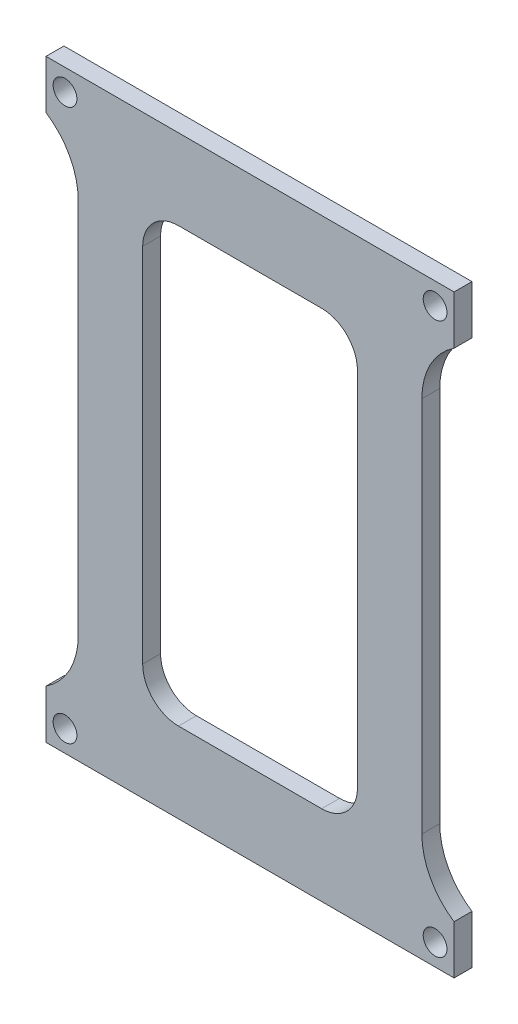
ISO-10303-21;
HEADER;
FILE_DESCRIPTION(('STEP AP214'),'2;1');
FILE_NAME('part.step','',(''),(''),'','','');
FILE_SCHEMA(('AUTOMOTIVE_DESIGN { 1 0 10303 214 1 1 1 1 }'));
ENDSEC;
DATA;
#1=APPLICATION_CONTEXT('core data for automotive mechanical design processes');
#2=APPLICATION_PROTOCOL_DEFINITION('international standard','automotive_design',2000,#1);
#3=PRODUCT_CONTEXT('',#1,'mechanical');
#4=PRODUCT('Part','Part','',(#3));
#5=PRODUCT_RELATED_PRODUCT_CATEGORY('part','',(#4));
#6=PRODUCT_DEFINITION_FORMATION('','',#4);
#7=PRODUCT_DEFINITION_CONTEXT('part definition',#1,'design');
#8=PRODUCT_DEFINITION('design','',#6,#7);
#9=PRODUCT_DEFINITION_SHAPE('','',#8);
#10=(LENGTH_UNIT() NAMED_UNIT(*) SI_UNIT(.MILLI.,.METRE.));
#11=(NAMED_UNIT(*) PLANE_ANGLE_UNIT() SI_UNIT($,.RADIAN.));
#12=(NAMED_UNIT(*) SI_UNIT($,.STERADIAN.) SOLID_ANGLE_UNIT());
#13=UNCERTAINTY_MEASURE_WITH_UNIT(LENGTH_MEASURE(1.E-05),#10,'distance_accuracy_value','');
#14=(GEOMETRIC_REPRESENTATION_CONTEXT(3) GLOBAL_UNCERTAINTY_ASSIGNED_CONTEXT((#13)) GLOBAL_UNIT_ASSIGNED_CONTEXT((#10,
#11,#12)) REPRESENTATION_CONTEXT('',''));
#15=CARTESIAN_POINT('',(0.,0.,0.));
#16=DIRECTION('',(0.,0.,1.));
#17=DIRECTION('',(1.,0.,0.));
#18=AXIS2_PLACEMENT_3D('',#15,#16,#17);
#19=CARTESIAN_POINT('',(-33.7285720078348,26.9956100105943,2.5));
#20=DIRECTION('',(0.,0.,1.));
#21=DIRECTION('',(1.,0.,0.));
#22=AXIS2_PLACEMENT_3D('',#19,#20,#21);
#23=PLANE('',#22);
#24=DIRECTION('',(0.,1.,0.));
#25=VECTOR('',#24,1.);
#26=CARTESIAN_POINT('',(28.7714279921653,48.9155209035442,2.5));
#27=LINE('',#26,#25);
#28=CARTESIAN_POINT('',(28.7714279921653,35.3472565548393,2.5));
#29=VERTEX_POINT('',#28);
#30=CARTESIAN_POINT('',(28.7714279921653,42.160761400506,2.5));
#31=VERTEX_POINT('',#30);
#32=EDGE_CURVE('E256',#29,#31,#27,.T.);
#33=ORIENTED_EDGE('',*,*,#32,.T.);
#34=DIRECTION('',(-1.,0.,0.));
#35=VECTOR('',#34,1.);
#36=CARTESIAN_POINT('',(21.9714279921651,42.160761400506,2.5));
#37=LINE('',#36,#35);
#38=CARTESIAN_POINT('',(-28.2285720078348,42.160761400506,2.5));
#39=VERTEX_POINT('',#38);
#40=EDGE_CURVE('E212',#31,#39,#37,.T.);
#41=ORIENTED_EDGE('',*,*,#40,.T.);
#42=DIRECTION('',(0.,-1.,0.));
#43=VECTOR('',#42,1.);
#44=CARTESIAN_POINT('',(-28.2285720078348,48.9155209035442,2.5));
#45=LINE('',#44,#43);
#46=CARTESIAN_POINT('',(-28.2285720078348,35.3472565548394,2.5));
#47=VERTEX_POINT('',#46);
#48=EDGE_CURVE('E180',#39,#47,#45,.T.);
#49=ORIENTED_EDGE('',*,*,#48,.T.);
#50=CARTESIAN_POINT('',(-33.7285720078348,26.9956100105943,2.5));
#51=DIRECTION('',(0.,0.,-1.));
#52=DIRECTION('',(1.,0.,0.));
#53=AXIS2_PLACEMENT_3D('',#50,#51,#52);
#54=CIRCLE('',#53,10.);
#55=CARTESIAN_POINT('',(-23.7285720078348,26.9956100105943,2.5));
#56=VERTEX_POINT('',#55);
#57=EDGE_CURVE('E198',#47,#56,#54,.T.);
#58=ORIENTED_EDGE('',*,*,#57,.T.);
#59=DIRECTION('',(0.,-1.,0.));
#60=VECTOR('',#59,1.);
#61=CARTESIAN_POINT('',(-23.7285720078348,-25.6740872095823,2.5));
#62=LINE('',#61,#60);
#63=CARTESIAN_POINT('',(-23.7285720078348,-25.6740872095823,2.5));
#64=VERTEX_POINT('',#63);
#65=EDGE_CURVE('E201',#56,#64,#62,.T.);
#66=ORIENTED_EDGE('',*,*,#65,.T.);
#67=CARTESIAN_POINT('',(-33.7285720078348,-25.6740872095823,2.5));
#68=DIRECTION('',(0.,0.,-1.));
#69=DIRECTION('',(1.,0.,0.));
#70=AXIS2_PLACEMENT_3D('',#67,#68,#69);
#71=CIRCLE('',#70,10.);
#72=CARTESIAN_POINT('',(-28.2285720078348,-34.0257337538274,2.5));
#73=VERTEX_POINT('',#72);
#74=EDGE_CURVE('E360',#64,#73,#71,.T.);
#75=ORIENTED_EDGE('',*,*,#74,.T.);
#76=CARTESIAN_POINT('',(-28.2285720078348,-40.839238599494,2.5));
#77=VERTEX_POINT('',#76);
#78=EDGE_CURVE('E259',#73,#77,#45,.T.);
#79=ORIENTED_EDGE('',*,*,#78,.T.);
#80=DIRECTION('',(1.,0.,0.));
#81=VECTOR('',#80,1.);
#82=CARTESIAN_POINT('',(-21.4285720078349,-40.839238599494,2.5));
#83=LINE('',#82,#81);
#84=CARTESIAN_POINT('',(28.7714279921653,-40.839238599494,2.5));
#85=VERTEX_POINT('',#84);
#86=EDGE_CURVE('E363',#77,#85,#83,.T.);
#87=ORIENTED_EDGE('',*,*,#86,.T.);
#88=CARTESIAN_POINT('',(28.7714279921653,-34.0257337538273,2.5));
#89=VERTEX_POINT('',#88);
#90=EDGE_CURVE('E265',#85,#89,#27,.T.);
#91=ORIENTED_EDGE('',*,*,#90,.T.);
#92=CARTESIAN_POINT('',(34.2714279921653,-25.6740872095823,2.5));
#93=DIRECTION('',(0.,0.,-1.));
#94=DIRECTION('',(1.,0.,0.));
#95=AXIS2_PLACEMENT_3D('',#92,#93,#94);
#96=CIRCLE('',#95,9.99999999999999);
#97=CARTESIAN_POINT('',(24.2714279921653,-25.6740872095824,2.5));
#98=VERTEX_POINT('',#97);
#99=EDGE_CURVE('E366',#89,#98,#96,.T.);
#100=ORIENTED_EDGE('',*,*,#99,.T.);
#101=DIRECTION('',(0.,1.,0.));
#102=VECTOR('',#101,1.);
#103=CARTESIAN_POINT('',(24.2714279921653,26.9956100105943,2.5));
#104=LINE('',#103,#102);
#105=CARTESIAN_POINT('',(24.2714279921653,26.9956100105943,2.5));
#106=VERTEX_POINT('',#105);
#107=EDGE_CURVE('E368',#98,#106,#104,.T.);
#108=ORIENTED_EDGE('',*,*,#107,.T.);
#109=CARTESIAN_POINT('',(34.2714279921653,26.9956100105943,2.5));
#110=DIRECTION('',(0.,0.,-1.));
#111=DIRECTION('',(1.,0.,0.));
#112=AXIS2_PLACEMENT_3D('',#109,#110,#111);
#113=CIRCLE('',#112,10.);
#114=EDGE_CURVE('E253',#106,#29,#113,.T.);
#115=ORIENTED_EDGE('',*,*,#114,.T.);
#116=EDGE_LOOP('',(#33,#41,#49,#58,#66,#75,#79,#87,#91,#100,#108,#115));
#117=FACE_BOUND('',#116,.T.);
#118=CARTESIAN_POINT('',(-25.5785720078348,-37.839238599494,2.5));
#119=DIRECTION('',(0.,0.,1.));
#120=DIRECTION('',(1.,0.,0.));
#121=AXIS2_PLACEMENT_3D('',#118,#119,#120);
#122=CIRCLE('',#121,1.66);
#123=CARTESIAN_POINT('',(-23.9185720078348,-37.839238599494,2.5));
#124=VERTEX_POINT('',#123);
#125=EDGE_CURVE('E343',#124,#124,#122,.T.);
#126=ORIENTED_EDGE('',*,*,#125,.F.);
#127=EDGE_LOOP('',(#126));
#128=FACE_BOUND('',#127,.T.);
#129=CARTESIAN_POINT('',(-25.5785720078348,39.160761400506,2.5));
#130=DIRECTION('',(0.,0.,1.));
#131=DIRECTION('',(1.,0.,0.));
#132=AXIS2_PLACEMENT_3D('',#129,#130,#131);
#133=CIRCLE('',#132,1.66);
#134=CARTESIAN_POINT('',(-23.9185720078348,39.160761400506,2.5));
#135=VERTEX_POINT('',#134);
#136=EDGE_CURVE('E233',#135,#135,#133,.T.);
#137=ORIENTED_EDGE('',*,*,#136,.F.);
#138=EDGE_LOOP('',(#137));
#139=FACE_BOUND('',#138,.T.);
#140=CARTESIAN_POINT('',(26.1214279921651,39.160761400506,2.5));
#141=DIRECTION('',(0.,0.,1.));
#142=DIRECTION('',(1.,0.,0.));
#143=AXIS2_PLACEMENT_3D('',#140,#141,#142);
#144=CIRCLE('',#143,1.66);
#145=CARTESIAN_POINT('',(27.7814279921651,39.160761400506,2.5));
#146=VERTEX_POINT('',#145);
#147=EDGE_CURVE('E349',#146,#146,#144,.T.);
#148=ORIENTED_EDGE('',*,*,#147,.F.);
#149=EDGE_LOOP('',(#148));
#150=FACE_BOUND('',#149,.T.);
#151=CARTESIAN_POINT('',(26.1214279921651,-37.839238599494,2.5));
#152=DIRECTION('',(0.,0.,1.));
#153=DIRECTION('',(1.,0.,0.));
#154=AXIS2_PLACEMENT_3D('',#151,#152,#153);
#155=CIRCLE('',#154,1.66);
#156=CARTESIAN_POINT('',(27.7814279921651,-37.839238599494,2.5));
#157=VERTEX_POINT('',#156);
#158=EDGE_CURVE('E337',#157,#157,#155,.T.);
#159=ORIENTED_EDGE('',*,*,#158,.F.);
#160=EDGE_LOOP('',(#159));
#161=FACE_BOUND('',#160,.T.);
#162=DIRECTION('',(1.,0.,0.));
#163=VECTOR('',#162,1.);
#164=CARTESIAN_POINT('',(-9.72857200783471,-29.6076384526286,2.5));
#165=LINE('',#164,#163);
#166=CARTESIAN_POINT('',(-9.72857200783471,-29.6076384526286,2.5));
#167=VERTEX_POINT('',#166);
#168=CARTESIAN_POINT('',(10.2714279921652,-29.6076384526286,2.5));
#169=VERTEX_POINT('',#168);
#170=EDGE_CURVE('E280',#167,#169,#165,.T.);
#171=ORIENTED_EDGE('',*,*,#170,.F.);
#172=CARTESIAN_POINT('',(-9.72857200783475,-24.6076384526286,2.5));
#173=DIRECTION('',(0.,0.,1.));
#174=DIRECTION('',(-1.,0.,0.));
#175=AXIS2_PLACEMENT_3D('',#172,#173,#174);
#176=CIRCLE('',#175,5.);
#177=CARTESIAN_POINT('',(-14.7285720078347,-24.6076384526285,2.5));
#178=VERTEX_POINT('',#177);
#179=EDGE_CURVE('E278',#178,#167,#176,.T.);
#180=ORIENTED_EDGE('',*,*,#179,.F.);
#181=DIRECTION('',(0.,-1.,0.));
#182=VECTOR('',#181,1.);
#183=CARTESIAN_POINT('',(-14.7285720078348,25.9291612536405,2.5));
#184=LINE('',#183,#182);
#185=CARTESIAN_POINT('',(-14.7285720078348,25.9291612536405,2.5));
#186=VERTEX_POINT('',#185);
#187=EDGE_CURVE('E294',#186,#178,#184,.T.);
#188=ORIENTED_EDGE('',*,*,#187,.F.);
#189=CARTESIAN_POINT('',(-9.72857200783475,25.9291612536406,2.5));
#190=DIRECTION('',(0.,0.,1.));
#191=DIRECTION('',(-1.,0.,0.));
#192=AXIS2_PLACEMENT_3D('',#189,#190,#191);
#193=CIRCLE('',#192,5.);
#194=CARTESIAN_POINT('',(-9.72857200783472,30.9291612536406,2.5));
#195=VERTEX_POINT('',#194);
#196=EDGE_CURVE('E291',#195,#186,#193,.T.);
#197=ORIENTED_EDGE('',*,*,#196,.F.);
#198=DIRECTION('',(-1.,0.,0.));
#199=VECTOR('',#198,1.);
#200=CARTESIAN_POINT('',(-9.72857200783472,30.9291612536406,2.5));
#201=LINE('',#200,#199);
#202=CARTESIAN_POINT('',(10.2714279921652,30.9291612536406,2.5));
#203=VERTEX_POINT('',#202);
#204=EDGE_CURVE('E289',#203,#195,#201,.T.);
#205=ORIENTED_EDGE('',*,*,#204,.F.);
#206=CARTESIAN_POINT('',(10.2714279921652,25.9291612536406,2.5));
#207=DIRECTION('',(0.,0.,1.));
#208=DIRECTION('',(-1.,0.,0.));
#209=AXIS2_PLACEMENT_3D('',#206,#207,#208);
#210=CIRCLE('',#209,5.);
#211=CARTESIAN_POINT('',(15.2714279921652,25.9291612536405,2.5));
#212=VERTEX_POINT('',#211);
#213=EDGE_CURVE('E287',#212,#203,#210,.T.);
#214=ORIENTED_EDGE('',*,*,#213,.F.);
#215=DIRECTION('',(0.,1.,0.));
#216=VECTOR('',#215,1.);
#217=CARTESIAN_POINT('',(15.2714279921652,25.9291612536405,2.5));
#218=LINE('',#217,#216);
#219=CARTESIAN_POINT('',(15.2714279921653,-24.6076384526285,2.5));
#220=VERTEX_POINT('',#219);
#221=EDGE_CURVE('E285',#220,#212,#218,.T.);
#222=ORIENTED_EDGE('',*,*,#221,.F.);
#223=CARTESIAN_POINT('',(10.2714279921653,-24.6076384526286,2.5));
#224=DIRECTION('',(0.,0.,1.));
#225=DIRECTION('',(-1.,0.,0.));
#226=AXIS2_PLACEMENT_3D('',#223,#224,#225);
#227=CIRCLE('',#226,5.);
#228=EDGE_CURVE('E283',#169,#220,#227,.T.);
#229=ORIENTED_EDGE('',*,*,#228,.F.);
#230=EDGE_LOOP('',(#171,#180,#188,#197,#205,#214,#222,#229));
#231=FACE_BOUND('',#230,.T.);
#232=ADVANCED_FACE('F39',(#117,#128,#139,#150,#161,#231),#23,.T.);
#233=CARTESIAN_POINT('',(-33.7285720078348,26.9956100105943,0.));
#234=DIRECTION('',(0.,0.,1.));
#235=DIRECTION('',(1.,0.,0.));
#236=AXIS2_PLACEMENT_3D('',#233,#234,#235);
#237=PLANE('',#236);
#238=CARTESIAN_POINT('',(26.1214279921651,-37.839238599494,0.));
#239=DIRECTION('',(0.,0.,1.));
#240=DIRECTION('',(1.,0.,0.));
#241=AXIS2_PLACEMENT_3D('',#238,#239,#240);
#242=CIRCLE('',#241,1.66);
#243=CARTESIAN_POINT('',(27.7814279921651,-37.839238599494,0.));
#244=VERTEX_POINT('',#243);
#245=EDGE_CURVE('E336',#244,#244,#242,.T.);
#246=ORIENTED_EDGE('',*,*,#245,.T.);
#247=EDGE_LOOP('',(#246));
#248=FACE_BOUND('',#247,.T.);
#249=CARTESIAN_POINT('',(-25.5785720078348,-37.839238599494,0.));
#250=DIRECTION('',(0.,0.,1.));
#251=DIRECTION('',(1.,0.,0.));
#252=AXIS2_PLACEMENT_3D('',#249,#250,#251);
#253=CIRCLE('',#252,1.66);
#254=CARTESIAN_POINT('',(-23.9185720078348,-37.839238599494,0.));
#255=VERTEX_POINT('',#254);
#256=EDGE_CURVE('E340',#255,#255,#253,.T.);
#257=ORIENTED_EDGE('',*,*,#256,.T.);
#258=EDGE_LOOP('',(#257));
#259=FACE_BOUND('',#258,.T.);
#260=CARTESIAN_POINT('',(26.1214279921651,39.160761400506,0.));
#261=DIRECTION('',(0.,0.,1.));
#262=DIRECTION('',(1.,0.,0.));
#263=AXIS2_PLACEMENT_3D('',#260,#261,#262);
#264=CIRCLE('',#263,1.66);
#265=CARTESIAN_POINT('',(27.7814279921651,39.160761400506,0.));
#266=VERTEX_POINT('',#265);
#267=EDGE_CURVE('E346',#266,#266,#264,.T.);
#268=ORIENTED_EDGE('',*,*,#267,.T.);
#269=EDGE_LOOP('',(#268));
#270=FACE_BOUND('',#269,.T.);
#271=CARTESIAN_POINT('',(-25.5785720078348,39.160761400506,0.));
#272=DIRECTION('',(0.,0.,1.));
#273=DIRECTION('',(1.,0.,0.));
#274=AXIS2_PLACEMENT_3D('',#271,#272,#273);
#275=CIRCLE('',#274,1.66);
#276=CARTESIAN_POINT('',(-23.9185720078348,39.160761400506,0.));
#277=VERTEX_POINT('',#276);
#278=EDGE_CURVE('E352',#277,#277,#275,.T.);
#279=ORIENTED_EDGE('',*,*,#278,.T.);
#280=EDGE_LOOP('',(#279));
#281=FACE_BOUND('',#280,.T.);
#282=DIRECTION('',(-1.,0.,0.));
#283=VECTOR('',#282,1.);
#284=CARTESIAN_POINT('',(-29.7285720078348,42.160761400506,0.));
#285=LINE('',#284,#283);
#286=CARTESIAN_POINT('',(28.7714279921653,42.160761400506,0.));
#287=VERTEX_POINT('',#286);
#288=CARTESIAN_POINT('',(-28.2285720078348,42.160761400506,0.));
#289=VERTEX_POINT('',#288);
#290=EDGE_CURVE('E192',#287,#289,#285,.T.);
#291=ORIENTED_EDGE('',*,*,#290,.F.);
#292=DIRECTION('',(0.,1.,0.));
#293=VECTOR('',#292,1.);
#294=CARTESIAN_POINT('',(28.7714279921653,48.9155209035442,0.));
#295=LINE('',#294,#293);
#296=CARTESIAN_POINT('',(28.7714279921653,35.3472565548393,0.));
#297=VERTEX_POINT('',#296);
#298=EDGE_CURVE('E195',#297,#287,#295,.T.);
#299=ORIENTED_EDGE('',*,*,#298,.F.);
#300=CARTESIAN_POINT('',(34.2714279921653,26.9956100105943,0.));
#301=DIRECTION('',(0.,0.,-1.));
#302=DIRECTION('',(1.,0.,0.));
#303=AXIS2_PLACEMENT_3D('',#300,#301,#302);
#304=CIRCLE('',#303,10.);
#305=CARTESIAN_POINT('',(24.2714279921653,26.9956100105943,0.));
#306=VERTEX_POINT('',#305);
#307=EDGE_CURVE('E199',#306,#297,#304,.T.);
#308=ORIENTED_EDGE('',*,*,#307,.F.);
#309=DIRECTION('',(0.,1.,0.));
#310=VECTOR('',#309,1.);
#311=CARTESIAN_POINT('',(24.2714279921653,26.9956100105943,0.));
#312=LINE('',#311,#310);
#313=CARTESIAN_POINT('',(24.2714279921653,-25.6740872095824,0.));
#314=VERTEX_POINT('',#313);
#315=EDGE_CURVE('E204',#314,#306,#312,.T.);
#316=ORIENTED_EDGE('',*,*,#315,.F.);
#317=CARTESIAN_POINT('',(34.2714279921653,-25.6740872095823,0.));
#318=DIRECTION('',(0.,0.,-1.));
#319=DIRECTION('',(1.,0.,0.));
#320=AXIS2_PLACEMENT_3D('',#317,#318,#319);
#321=CIRCLE('',#320,9.99999999999999);
#322=CARTESIAN_POINT('',(28.7714279921653,-34.0257337538273,0.));
#323=VERTEX_POINT('',#322);
#324=EDGE_CURVE('E239',#323,#314,#321,.T.);
#325=ORIENTED_EDGE('',*,*,#324,.F.);
#326=CARTESIAN_POINT('',(28.7714279921653,-40.839238599494,0.));
#327=VERTEX_POINT('',#326);
#328=EDGE_CURVE('E62',#327,#323,#295,.T.);
#329=ORIENTED_EDGE('',*,*,#328,.F.);
#330=DIRECTION('',(1.,0.,0.));
#331=VECTOR('',#330,1.);
#332=CARTESIAN_POINT('',(30.2714279921653,-40.839238599494,0.));
#333=LINE('',#332,#331);
#334=CARTESIAN_POINT('',(-28.2285720078348,-40.839238599494,0.));
#335=VERTEX_POINT('',#334);
#336=EDGE_CURVE('E231',#335,#327,#333,.T.);
#337=ORIENTED_EDGE('',*,*,#336,.F.);
#338=DIRECTION('',(0.,-1.,0.));
#339=VECTOR('',#338,1.);
#340=CARTESIAN_POINT('',(-28.2285720078348,48.9155209035442,0.));
#341=LINE('',#340,#339);
#342=CARTESIAN_POINT('',(-28.2285720078348,-34.0257337538274,0.));
#343=VERTEX_POINT('',#342);
#344=EDGE_CURVE('E54',#343,#335,#341,.T.);
#345=ORIENTED_EDGE('',*,*,#344,.F.);
#346=CARTESIAN_POINT('',(-33.7285720078348,-25.6740872095823,0.));
#347=DIRECTION('',(0.,0.,-1.));
#348=DIRECTION('',(1.,0.,0.));
#349=AXIS2_PLACEMENT_3D('',#346,#347,#348);
#350=CIRCLE('',#349,10.);
#351=CARTESIAN_POINT('',(-23.7285720078348,-25.6740872095823,0.));
#352=VERTEX_POINT('',#351);
#353=EDGE_CURVE('E229',#352,#343,#350,.T.);
#354=ORIENTED_EDGE('',*,*,#353,.F.);
#355=DIRECTION('',(0.,-1.,0.));
#356=VECTOR('',#355,1.);
#357=CARTESIAN_POINT('',(-23.7285720078348,-25.6740872095823,0.));
#358=LINE('',#357,#356);
#359=CARTESIAN_POINT('',(-23.7285720078348,26.9956100105943,0.));
#360=VERTEX_POINT('',#359);
#361=EDGE_CURVE('E224',#360,#352,#358,.T.);
#362=ORIENTED_EDGE('',*,*,#361,.F.);
#363=CARTESIAN_POINT('',(-33.7285720078348,26.9956100105943,0.));
#364=DIRECTION('',(0.,0.,-1.));
#365=DIRECTION('',(1.,0.,0.));
#366=AXIS2_PLACEMENT_3D('',#363,#364,#365);
#367=CIRCLE('',#366,10.);
#368=CARTESIAN_POINT('',(-28.2285720078348,35.3472565548394,0.));
#369=VERTEX_POINT('',#368);
#370=EDGE_CURVE('E194',#369,#360,#367,.T.);
#371=ORIENTED_EDGE('',*,*,#370,.F.);
#372=EDGE_CURVE('E177',#289,#369,#341,.T.);
#373=ORIENTED_EDGE('',*,*,#372,.F.);
#374=EDGE_LOOP('',(#291,#299,#308,#316,#325,#329,#337,#345,#354,#362,#371,#373));
#375=FACE_BOUND('',#374,.T.);
#376=CARTESIAN_POINT('',(-9.72857200783475,-24.6076384526286,0.));
#377=DIRECTION('',(0.,0.,1.));
#378=DIRECTION('',(-1.,0.,0.));
#379=AXIS2_PLACEMENT_3D('',#376,#377,#378);
#380=CIRCLE('',#379,5.);
#381=CARTESIAN_POINT('',(-14.7285720078347,-24.6076384526285,0.));
#382=VERTEX_POINT('',#381);
#383=CARTESIAN_POINT('',(-9.72857200783471,-29.6076384526286,0.));
#384=VERTEX_POINT('',#383);
#385=EDGE_CURVE('E277',#382,#384,#380,.T.);
#386=ORIENTED_EDGE('',*,*,#385,.T.);
#387=DIRECTION('',(1.,0.,0.));
#388=VECTOR('',#387,1.);
#389=CARTESIAN_POINT('',(-9.72857200783471,-29.6076384526286,0.));
#390=LINE('',#389,#388);
#391=CARTESIAN_POINT('',(10.2714279921652,-29.6076384526286,0.));
#392=VERTEX_POINT('',#391);
#393=EDGE_CURVE('E299',#384,#392,#390,.T.);
#394=ORIENTED_EDGE('',*,*,#393,.T.);
#395=CARTESIAN_POINT('',(10.2714279921653,-24.6076384526286,0.));
#396=DIRECTION('',(0.,0.,1.));
#397=DIRECTION('',(-1.,0.,0.));
#398=AXIS2_PLACEMENT_3D('',#395,#396,#397);
#399=CIRCLE('',#398,5.);
#400=CARTESIAN_POINT('',(15.2714279921653,-24.6076384526285,0.));
#401=VERTEX_POINT('',#400);
#402=EDGE_CURVE('E302',#392,#401,#399,.T.);
#403=ORIENTED_EDGE('',*,*,#402,.T.);
#404=DIRECTION('',(0.,1.,0.));
#405=VECTOR('',#404,1.);
#406=CARTESIAN_POINT('',(15.2714279921652,25.9291612536405,0.));
#407=LINE('',#406,#405);
#408=CARTESIAN_POINT('',(15.2714279921652,25.9291612536405,0.));
#409=VERTEX_POINT('',#408);
#410=EDGE_CURVE('E305',#401,#409,#407,.T.);
#411=ORIENTED_EDGE('',*,*,#410,.T.);
#412=CARTESIAN_POINT('',(10.2714279921652,25.9291612536406,0.));
#413=DIRECTION('',(0.,0.,1.));
#414=DIRECTION('',(-1.,0.,0.));
#415=AXIS2_PLACEMENT_3D('',#412,#413,#414);
#416=CIRCLE('',#415,5.);
#417=CARTESIAN_POINT('',(10.2714279921652,30.9291612536406,0.));
#418=VERTEX_POINT('',#417);
#419=EDGE_CURVE('E308',#409,#418,#416,.T.);
#420=ORIENTED_EDGE('',*,*,#419,.T.);
#421=DIRECTION('',(-1.,0.,0.));
#422=VECTOR('',#421,1.);
#423=CARTESIAN_POINT('',(-9.72857200783472,30.9291612536406,0.));
#424=LINE('',#423,#422);
#425=CARTESIAN_POINT('',(-9.72857200783472,30.9291612536406,0.));
#426=VERTEX_POINT('',#425);
#427=EDGE_CURVE('E311',#418,#426,#424,.T.);
#428=ORIENTED_EDGE('',*,*,#427,.T.);
#429=CARTESIAN_POINT('',(-9.72857200783475,25.9291612536406,0.));
#430=DIRECTION('',(0.,0.,1.));
#431=DIRECTION('',(-1.,0.,0.));
#432=AXIS2_PLACEMENT_3D('',#429,#430,#431);
#433=CIRCLE('',#432,5.);
#434=CARTESIAN_POINT('',(-14.7285720078348,25.9291612536405,0.));
#435=VERTEX_POINT('',#434);
#436=EDGE_CURVE('E314',#426,#435,#433,.T.);
#437=ORIENTED_EDGE('',*,*,#436,.T.);
#438=DIRECTION('',(0.,-1.,0.));
#439=VECTOR('',#438,1.);
#440=CARTESIAN_POINT('',(-14.7285720078348,25.9291612536405,0.));
#441=LINE('',#440,#439);
#442=EDGE_CURVE('E281',#435,#382,#441,.T.);
#443=ORIENTED_EDGE('',*,*,#442,.T.);
#444=EDGE_LOOP('',(#386,#394,#403,#411,#420,#428,#437,#443));
#445=FACE_BOUND('',#444,.T.);
#446=ADVANCED_FACE('F189',(#248,#259,#270,#281,#375,#445),#237,.F.);
#447=CARTESIAN_POINT('',(-33.7285720078348,26.9956100105943,2.5));
#448=DIRECTION('',(0.,0.,-1.));
#449=DIRECTION('',(-1.,0.,0.));
#450=AXIS2_PLACEMENT_3D('',#447,#448,#449);
#451=CYLINDRICAL_SURFACE('',#450,10.);
#452=ORIENTED_EDGE('',*,*,#57,.F.);
#453=DIRECTION('',(0.,0.,-1.));
#454=VECTOR('',#453,1.);
#455=CARTESIAN_POINT('',(-28.2285720078348,35.3472565548394,2.5));
#456=LINE('',#455,#454);
#457=EDGE_CURVE('E268',#47,#369,#456,.T.);
#458=ORIENTED_EDGE('',*,*,#457,.T.);
#459=ORIENTED_EDGE('',*,*,#370,.T.);
#460=DIRECTION('',(0.,0.,-1.));
#461=VECTOR('',#460,1.);
#462=CARTESIAN_POINT('',(-23.7285720078348,26.9956100105943,2.5));
#463=LINE('',#462,#461);
#464=EDGE_CURVE('E185',#56,#360,#463,.T.);
#465=ORIENTED_EDGE('',*,*,#464,.F.);
#466=EDGE_LOOP('',(#452,#458,#459,#465));
#467=FACE_BOUND('',#466,.T.);
#468=ADVANCED_FACE('F41',(#467),#451,.F.);
#469=CARTESIAN_POINT('',(-23.7285720078348,-25.6740872095823,2.5));
#470=DIRECTION('',(1.,0.,0.));
#471=DIRECTION('',(0.,0.,-1.));
#472=AXIS2_PLACEMENT_3D('',#469,#470,#471);
#473=PLANE('',#472);
#474=ORIENTED_EDGE('',*,*,#361,.T.);
#475=DIRECTION('',(0.,0.,-1.));
#476=VECTOR('',#475,1.);
#477=CARTESIAN_POINT('',(-23.7285720078348,-25.6740872095823,2.5));
#478=LINE('',#477,#476);
#479=EDGE_CURVE('E215',#64,#352,#478,.T.);
#480=ORIENTED_EDGE('',*,*,#479,.F.);
#481=ORIENTED_EDGE('',*,*,#65,.F.);
#482=ORIENTED_EDGE('',*,*,#464,.T.);
#483=EDGE_LOOP('',(#474,#480,#481,#482));
#484=FACE_BOUND('',#483,.T.);
#485=ADVANCED_FACE('F222',(#484),#473,.F.);
#486=CARTESIAN_POINT('',(-33.7285720078348,-25.6740872095823,2.5));
#487=DIRECTION('',(0.,0.,-1.));
#488=DIRECTION('',(-1.,0.,0.));
#489=AXIS2_PLACEMENT_3D('',#486,#487,#488);
#490=CYLINDRICAL_SURFACE('',#489,10.);
#491=ORIENTED_EDGE('',*,*,#353,.T.);
#492=DIRECTION('',(0.,0.,-1.));
#493=VECTOR('',#492,1.);
#494=CARTESIAN_POINT('',(-28.2285720078348,-34.0257337538274,2.5));
#495=LINE('',#494,#493);
#496=EDGE_CURVE('E264',#343,#73,#495,.F.);
#497=ORIENTED_EDGE('',*,*,#496,.T.);
#498=ORIENTED_EDGE('',*,*,#74,.F.);
#499=ORIENTED_EDGE('',*,*,#479,.T.);
#500=EDGE_LOOP('',(#491,#497,#498,#499));
#501=FACE_BOUND('',#500,.T.);
#502=ADVANCED_FACE('F384',(#501),#490,.F.);
#503=CARTESIAN_POINT('',(30.2714279921653,-40.839238599494,2.5));
#504=DIRECTION('',(0.,1.,0.));
#505=DIRECTION('',(0.,0.,1.));
#506=AXIS2_PLACEMENT_3D('',#503,#504,#505);
#507=PLANE('',#506);
#508=ORIENTED_EDGE('',*,*,#336,.T.);
#509=DIRECTION('',(0.,0.,1.));
#510=VECTOR('',#509,1.);
#511=CARTESIAN_POINT('',(28.7714279921653,-40.839238599494,2.5));
#512=LINE('',#511,#510);
#513=EDGE_CURVE('E274',#327,#85,#512,.T.);
#514=ORIENTED_EDGE('',*,*,#513,.T.);
#515=ORIENTED_EDGE('',*,*,#86,.F.);
#516=DIRECTION('',(0.,0.,-1.));
#517=VECTOR('',#516,1.);
#518=CARTESIAN_POINT('',(-28.2285720078348,-40.839238599494,2.5));
#519=LINE('',#518,#517);
#520=EDGE_CURVE('E262',#77,#335,#519,.T.);
#521=ORIENTED_EDGE('',*,*,#520,.T.);
#522=EDGE_LOOP('',(#508,#514,#515,#521));
#523=FACE_BOUND('',#522,.T.);
#524=ADVANCED_FACE('F380',(#523),#507,.F.);
#525=CARTESIAN_POINT('',(34.2714279921653,-25.6740872095823,2.5));
#526=DIRECTION('',(0.,0.,-1.));
#527=DIRECTION('',(-1.,0.,0.));
#528=AXIS2_PLACEMENT_3D('',#525,#526,#527);
#529=CYLINDRICAL_SURFACE('',#528,9.99999999999999);
#530=ORIENTED_EDGE('',*,*,#99,.F.);
#531=DIRECTION('',(0.,0.,-1.));
#532=VECTOR('',#531,1.);
#533=CARTESIAN_POINT('',(28.7714279921653,-34.0257337538273,2.5));
#534=LINE('',#533,#532);
#535=EDGE_CURVE('E272',#89,#323,#534,.T.);
#536=ORIENTED_EDGE('',*,*,#535,.T.);
#537=ORIENTED_EDGE('',*,*,#324,.T.);
#538=DIRECTION('',(0.,0.,-1.));
#539=VECTOR('',#538,1.);
#540=CARTESIAN_POINT('',(24.2714279921653,-25.6740872095824,2.5));
#541=LINE('',#540,#539);
#542=EDGE_CURVE('E211',#98,#314,#541,.T.);
#543=ORIENTED_EDGE('',*,*,#542,.F.);
#544=EDGE_LOOP('',(#530,#536,#537,#543));
#545=FACE_BOUND('',#544,.T.);
#546=ADVANCED_FACE('F377',(#545),#529,.F.);
#547=CARTESIAN_POINT('',(24.2714279921653,26.9956100105943,2.5));
#548=DIRECTION('',(-1.,0.,0.));
#549=DIRECTION('',(0.,-1.,0.));
#550=AXIS2_PLACEMENT_3D('',#547,#548,#549);
#551=PLANE('',#550);
#552=ORIENTED_EDGE('',*,*,#315,.T.);
#553=DIRECTION('',(0.,0.,-1.));
#554=VECTOR('',#553,1.);
#555=CARTESIAN_POINT('',(24.2714279921653,26.9956100105943,2.5));
#556=LINE('',#555,#554);
#557=EDGE_CURVE('E208',#106,#306,#556,.T.);
#558=ORIENTED_EDGE('',*,*,#557,.F.);
#559=ORIENTED_EDGE('',*,*,#107,.F.);
#560=ORIENTED_EDGE('',*,*,#542,.T.);
#561=EDGE_LOOP('',(#552,#558,#559,#560));
#562=FACE_BOUND('',#561,.T.);
#563=ADVANCED_FACE('F243',(#562),#551,.F.);
#564=CARTESIAN_POINT('',(34.2714279921653,26.9956100105943,2.5));
#565=DIRECTION('',(0.,0.,-1.));
#566=DIRECTION('',(-1.,0.,0.));
#567=AXIS2_PLACEMENT_3D('',#564,#565,#566);
#568=CYLINDRICAL_SURFACE('',#567,10.);
#569=ORIENTED_EDGE('',*,*,#307,.T.);
#570=DIRECTION('',(0.,0.,-1.));
#571=VECTOR('',#570,1.);
#572=CARTESIAN_POINT('',(28.7714279921653,35.3472565548393,2.5));
#573=LINE('',#572,#571);
#574=EDGE_CURVE('E270',#297,#29,#573,.F.);
#575=ORIENTED_EDGE('',*,*,#574,.T.);
#576=ORIENTED_EDGE('',*,*,#114,.F.);
#577=ORIENTED_EDGE('',*,*,#557,.T.);
#578=EDGE_LOOP('',(#569,#575,#576,#577));
#579=FACE_BOUND('',#578,.T.);
#580=ADVANCED_FACE('F250',(#579),#568,.F.);
#581=CARTESIAN_POINT('',(-29.7285720078348,42.160761400506,2.5));
#582=DIRECTION('',(0.,-1.,0.));
#583=DIRECTION('',(0.,0.,-1.));
#584=AXIS2_PLACEMENT_3D('',#581,#582,#583);
#585=PLANE('',#584);
#586=ORIENTED_EDGE('',*,*,#40,.F.);
#587=DIRECTION('',(0.,0.,-1.));
#588=VECTOR('',#587,1.);
#589=CARTESIAN_POINT('',(28.7714279921653,42.160761400506,2.5));
#590=LINE('',#589,#588);
#591=EDGE_CURVE('E11',#31,#287,#590,.T.);
#592=ORIENTED_EDGE('',*,*,#591,.T.);
#593=ORIENTED_EDGE('',*,*,#290,.T.);
#594=DIRECTION('',(0.,0.,1.));
#595=VECTOR('',#594,1.);
#596=CARTESIAN_POINT('',(-28.2285720078348,42.160761400506,2.5));
#597=LINE('',#596,#595);
#598=EDGE_CURVE('E47',#289,#39,#597,.T.);
#599=ORIENTED_EDGE('',*,*,#598,.T.);
#600=EDGE_LOOP('',(#586,#592,#593,#599));
#601=FACE_BOUND('',#600,.T.);
#602=ADVANCED_FACE('F197',(#601),#585,.F.);
#603=CARTESIAN_POINT('',(-25.5785720078348,39.160761400506,2.5));
#604=DIRECTION('',(0.,0.,-1.));
#605=DIRECTION('',(-1.,0.,0.));
#606=AXIS2_PLACEMENT_3D('',#603,#604,#605);
#607=CYLINDRICAL_SURFACE('',#606,1.66);
#608=ORIENTED_EDGE('',*,*,#136,.T.);
#609=EDGE_LOOP('',(#608));
#610=FACE_BOUND('',#609,.T.);
#611=ORIENTED_EDGE('',*,*,#278,.F.);
#612=EDGE_LOOP('',(#611));
#613=FACE_BOUND('',#612,.T.);
#614=ADVANCED_FACE('F402',(#610,#613),#607,.F.);
#615=CARTESIAN_POINT('',(26.1214279921651,39.160761400506,2.5));
#616=DIRECTION('',(0.,0.,-1.));
#617=DIRECTION('',(-1.,0.,0.));
#618=AXIS2_PLACEMENT_3D('',#615,#616,#617);
#619=CYLINDRICAL_SURFACE('',#618,1.66);
#620=ORIENTED_EDGE('',*,*,#147,.T.);
#621=EDGE_LOOP('',(#620));
#622=FACE_BOUND('',#621,.T.);
#623=ORIENTED_EDGE('',*,*,#267,.F.);
#624=EDGE_LOOP('',(#623));
#625=FACE_BOUND('',#624,.T.);
#626=ADVANCED_FACE('F550',(#622,#625),#619,.F.);
#627=CARTESIAN_POINT('',(-25.5785720078348,-37.839238599494,2.5));
#628=DIRECTION('',(0.,0.,-1.));
#629=DIRECTION('',(-1.,0.,0.));
#630=AXIS2_PLACEMENT_3D('',#627,#628,#629);
#631=CYLINDRICAL_SURFACE('',#630,1.66);
#632=ORIENTED_EDGE('',*,*,#125,.T.);
#633=EDGE_LOOP('',(#632));
#634=FACE_BOUND('',#633,.T.);
#635=ORIENTED_EDGE('',*,*,#256,.F.);
#636=EDGE_LOOP('',(#635));
#637=FACE_BOUND('',#636,.T.);
#638=ADVANCED_FACE('F541',(#634,#637),#631,.F.);
#639=CARTESIAN_POINT('',(26.1214279921651,-37.839238599494,2.5));
#640=DIRECTION('',(0.,0.,-1.));
#641=DIRECTION('',(-1.,0.,0.));
#642=AXIS2_PLACEMENT_3D('',#639,#640,#641);
#643=CYLINDRICAL_SURFACE('',#642,1.66);
#644=ORIENTED_EDGE('',*,*,#158,.T.);
#645=EDGE_LOOP('',(#644));
#646=FACE_BOUND('',#645,.T.);
#647=ORIENTED_EDGE('',*,*,#245,.F.);
#648=EDGE_LOOP('',(#647));
#649=FACE_BOUND('',#648,.T.);
#650=ADVANCED_FACE('F532',(#646,#649),#643,.F.);
#651=CARTESIAN_POINT('',(-9.72857200783475,-24.6076384526286,2.5));
#652=DIRECTION('',(0.,0.,-1.));
#653=DIRECTION('',(-1.,0.,0.));
#654=AXIS2_PLACEMENT_3D('',#651,#652,#653);
#655=CYLINDRICAL_SURFACE('',#654,5.);
#656=ORIENTED_EDGE('',*,*,#385,.F.);
#657=DIRECTION('',(0.,0.,-1.));
#658=VECTOR('',#657,1.);
#659=CARTESIAN_POINT('',(-14.7285720078347,-24.6076384526285,2.5));
#660=LINE('',#659,#658);
#661=EDGE_CURVE('E296',#178,#382,#660,.T.);
#662=ORIENTED_EDGE('',*,*,#661,.F.);
#663=ORIENTED_EDGE('',*,*,#179,.T.);
#664=DIRECTION('',(0.,0.,-1.));
#665=VECTOR('',#664,1.);
#666=CARTESIAN_POINT('',(-9.72857200783471,-29.6076384526286,2.5));
#667=LINE('',#666,#665);
#668=EDGE_CURVE('E333',#167,#384,#667,.T.);
#669=ORIENTED_EDGE('',*,*,#668,.T.);
#670=EDGE_LOOP('',(#656,#662,#663,#669));
#671=FACE_BOUND('',#670,.T.);
#672=ADVANCED_FACE('F523',(#671),#655,.F.);
#673=CARTESIAN_POINT('',(-9.72857200783471,-29.6076384526286,2.5));
#674=DIRECTION('',(0.,1.,0.));
#675=DIRECTION('',(0.,0.,1.));
#676=AXIS2_PLACEMENT_3D('',#673,#674,#675);
#677=PLANE('',#676);
#678=ORIENTED_EDGE('',*,*,#393,.F.);
#679=ORIENTED_EDGE('',*,*,#668,.F.);
#680=ORIENTED_EDGE('',*,*,#170,.T.);
#681=DIRECTION('',(0.,0.,-1.));
#682=VECTOR('',#681,1.);
#683=CARTESIAN_POINT('',(10.2714279921652,-29.6076384526286,2.5));
#684=LINE('',#683,#682);
#685=EDGE_CURVE('E331',#169,#392,#684,.T.);
#686=ORIENTED_EDGE('',*,*,#685,.T.);
#687=EDGE_LOOP('',(#678,#679,#680,#686));
#688=FACE_BOUND('',#687,.T.);
#689=ADVANCED_FACE('F514',(#688),#677,.T.);
#690=CARTESIAN_POINT('',(10.2714279921653,-24.6076384526286,2.5));
#691=DIRECTION('',(0.,0.,-1.));
#692=DIRECTION('',(-1.,0.,0.));
#693=AXIS2_PLACEMENT_3D('',#690,#691,#692);
#694=CYLINDRICAL_SURFACE('',#693,5.);
#695=ORIENTED_EDGE('',*,*,#402,.F.);
#696=ORIENTED_EDGE('',*,*,#685,.F.);
#697=ORIENTED_EDGE('',*,*,#228,.T.);
#698=DIRECTION('',(0.,0.,-1.));
#699=VECTOR('',#698,1.);
#700=CARTESIAN_POINT('',(15.2714279921653,-24.6076384526285,2.5));
#701=LINE('',#700,#699);
#702=EDGE_CURVE('E329',#220,#401,#701,.T.);
#703=ORIENTED_EDGE('',*,*,#702,.T.);
#704=EDGE_LOOP('',(#695,#696,#697,#703));
#705=FACE_BOUND('',#704,.T.);
#706=ADVANCED_FACE('F505',(#705),#694,.F.);
#707=CARTESIAN_POINT('',(15.2714279921652,25.9291612536405,2.5));
#708=DIRECTION('',(-1.,0.,0.));
#709=DIRECTION('',(0.,-1.,0.));
#710=AXIS2_PLACEMENT_3D('',#707,#708,#709);
#711=PLANE('',#710);
#712=ORIENTED_EDGE('',*,*,#410,.F.);
#713=ORIENTED_EDGE('',*,*,#702,.F.);
#714=ORIENTED_EDGE('',*,*,#221,.T.);
#715=DIRECTION('',(0.,0.,-1.));
#716=VECTOR('',#715,1.);
#717=CARTESIAN_POINT('',(15.2714279921652,25.9291612536405,2.5));
#718=LINE('',#717,#716);
#719=EDGE_CURVE('E327',#212,#409,#718,.T.);
#720=ORIENTED_EDGE('',*,*,#719,.T.);
#721=EDGE_LOOP('',(#712,#713,#714,#720));
#722=FACE_BOUND('',#721,.T.);
#723=ADVANCED_FACE('F496',(#722),#711,.T.);
#724=CARTESIAN_POINT('',(10.2714279921652,25.9291612536406,2.5));
#725=DIRECTION('',(0.,0.,-1.));
#726=DIRECTION('',(-1.,0.,0.));
#727=AXIS2_PLACEMENT_3D('',#724,#725,#726);
#728=CYLINDRICAL_SURFACE('',#727,5.);
#729=ORIENTED_EDGE('',*,*,#419,.F.);
#730=ORIENTED_EDGE('',*,*,#719,.F.);
#731=ORIENTED_EDGE('',*,*,#213,.T.);
#732=DIRECTION('',(0.,0.,-1.));
#733=VECTOR('',#732,1.);
#734=CARTESIAN_POINT('',(10.2714279921652,30.9291612536406,2.5));
#735=LINE('',#734,#733);
#736=EDGE_CURVE('E325',#203,#418,#735,.T.);
#737=ORIENTED_EDGE('',*,*,#736,.T.);
#738=EDGE_LOOP('',(#729,#730,#731,#737));
#739=FACE_BOUND('',#738,.T.);
#740=ADVANCED_FACE('F487',(#739),#728,.F.);
#741=CARTESIAN_POINT('',(-9.72857200783472,30.9291612536406,2.5));
#742=DIRECTION('',(0.,-1.,0.));
#743=DIRECTION('',(0.,0.,-1.));
#744=AXIS2_PLACEMENT_3D('',#741,#742,#743);
#745=PLANE('',#744);
#746=ORIENTED_EDGE('',*,*,#427,.F.);
#747=ORIENTED_EDGE('',*,*,#736,.F.);
#748=ORIENTED_EDGE('',*,*,#204,.T.);
#749=DIRECTION('',(0.,0.,-1.));
#750=VECTOR('',#749,1.);
#751=CARTESIAN_POINT('',(-9.72857200783472,30.9291612536406,2.5));
#752=LINE('',#751,#750);
#753=EDGE_CURVE('E323',#195,#426,#752,.T.);
#754=ORIENTED_EDGE('',*,*,#753,.T.);
#755=EDGE_LOOP('',(#746,#747,#748,#754));
#756=FACE_BOUND('',#755,.T.);
#757=ADVANCED_FACE('F478',(#756),#745,.T.);
#758=CARTESIAN_POINT('',(-9.72857200783475,25.9291612536406,2.5));
#759=DIRECTION('',(0.,0.,-1.));
#760=DIRECTION('',(-1.,0.,0.));
#761=AXIS2_PLACEMENT_3D('',#758,#759,#760);
#762=CYLINDRICAL_SURFACE('',#761,5.);
#763=ORIENTED_EDGE('',*,*,#436,.F.);
#764=ORIENTED_EDGE('',*,*,#753,.F.);
#765=ORIENTED_EDGE('',*,*,#196,.T.);
#766=DIRECTION('',(0.,0.,-1.));
#767=VECTOR('',#766,1.);
#768=CARTESIAN_POINT('',(-14.7285720078348,25.9291612536405,2.5));
#769=LINE('',#768,#767);
#770=EDGE_CURVE('E321',#186,#435,#769,.T.);
#771=ORIENTED_EDGE('',*,*,#770,.T.);
#772=EDGE_LOOP('',(#763,#764,#765,#771));
#773=FACE_BOUND('',#772,.T.);
#774=ADVANCED_FACE('F469',(#773),#762,.F.);
#775=CARTESIAN_POINT('',(-14.7285720078348,25.9291612536405,2.5));
#776=DIRECTION('',(1.,0.,0.));
#777=DIRECTION('',(0.,1.,0.));
#778=AXIS2_PLACEMENT_3D('',#775,#776,#777);
#779=PLANE('',#778);
#780=ORIENTED_EDGE('',*,*,#442,.F.);
#781=ORIENTED_EDGE('',*,*,#770,.F.);
#782=ORIENTED_EDGE('',*,*,#187,.T.);
#783=ORIENTED_EDGE('',*,*,#661,.T.);
#784=EDGE_LOOP('',(#780,#781,#782,#783));
#785=FACE_BOUND('',#784,.T.);
#786=ADVANCED_FACE('F437',(#785),#779,.T.);
#787=CARTESIAN_POINT('',(-28.2285720078348,48.9155209035442,2.5));
#788=DIRECTION('',(1.,0.,0.));
#789=DIRECTION('',(0.,1.,0.));
#790=AXIS2_PLACEMENT_3D('',#787,#788,#789);
#791=PLANE('',#790);
#792=ORIENTED_EDGE('',*,*,#48,.F.);
#793=ORIENTED_EDGE('',*,*,#598,.F.);
#794=ORIENTED_EDGE('',*,*,#372,.T.);
#795=ORIENTED_EDGE('',*,*,#457,.F.);
#796=EDGE_LOOP('',(#792,#793,#794,#795));
#797=FACE_BOUND('',#796,.T.);
#798=ADVANCED_FACE('F176',(#797),#791,.F.);
#799=CARTESIAN_POINT('',(28.7714279921653,48.9155209035442,2.5));
#800=DIRECTION('',(-1.,0.,0.));
#801=DIRECTION('',(0.,-1.,0.));
#802=AXIS2_PLACEMENT_3D('',#799,#800,#801);
#803=PLANE('',#802);
#804=ORIENTED_EDGE('',*,*,#298,.T.);
#805=ORIENTED_EDGE('',*,*,#591,.F.);
#806=ORIENTED_EDGE('',*,*,#32,.F.);
#807=ORIENTED_EDGE('',*,*,#574,.F.);
#808=EDGE_LOOP('',(#804,#805,#806,#807));
#809=FACE_BOUND('',#808,.T.);
#810=ADVANCED_FACE('F436',(#809),#803,.F.);
#811=ORIENTED_EDGE('',*,*,#328,.T.);
#812=ORIENTED_EDGE('',*,*,#535,.F.);
#813=ORIENTED_EDGE('',*,*,#90,.F.);
#814=ORIENTED_EDGE('',*,*,#513,.F.);
#815=EDGE_LOOP('',(#811,#812,#813,#814));
#816=FACE_BOUND('',#815,.T.);
#817=ADVANCED_FACE('F446',(#816),#803,.F.);
#818=ORIENTED_EDGE('',*,*,#344,.T.);
#819=ORIENTED_EDGE('',*,*,#520,.F.);
#820=ORIENTED_EDGE('',*,*,#78,.F.);
#821=ORIENTED_EDGE('',*,*,#496,.F.);
#822=EDGE_LOOP('',(#818,#819,#820,#821));
#823=FACE_BOUND('',#822,.T.);
#824=ADVANCED_FACE('F381',(#823),#791,.F.);
#825=CLOSED_SHELL('',(#232,#446,#468,#485,#502,#524,#546,#563,#580,#602,#614,#626,#638,#650,
#672,#689,#706,#723,#740,#757,#774,#786,#798,#810,#817,#824));
#826=MANIFOLD_SOLID_BREP('B2',#825);
#827=ADVANCED_BREP_SHAPE_REPRESENTATION('',(#18,#826),#14);
#828=SHAPE_DEFINITION_REPRESENTATION(#9,#827);
ENDSEC;
END-ISO-10303-21;
